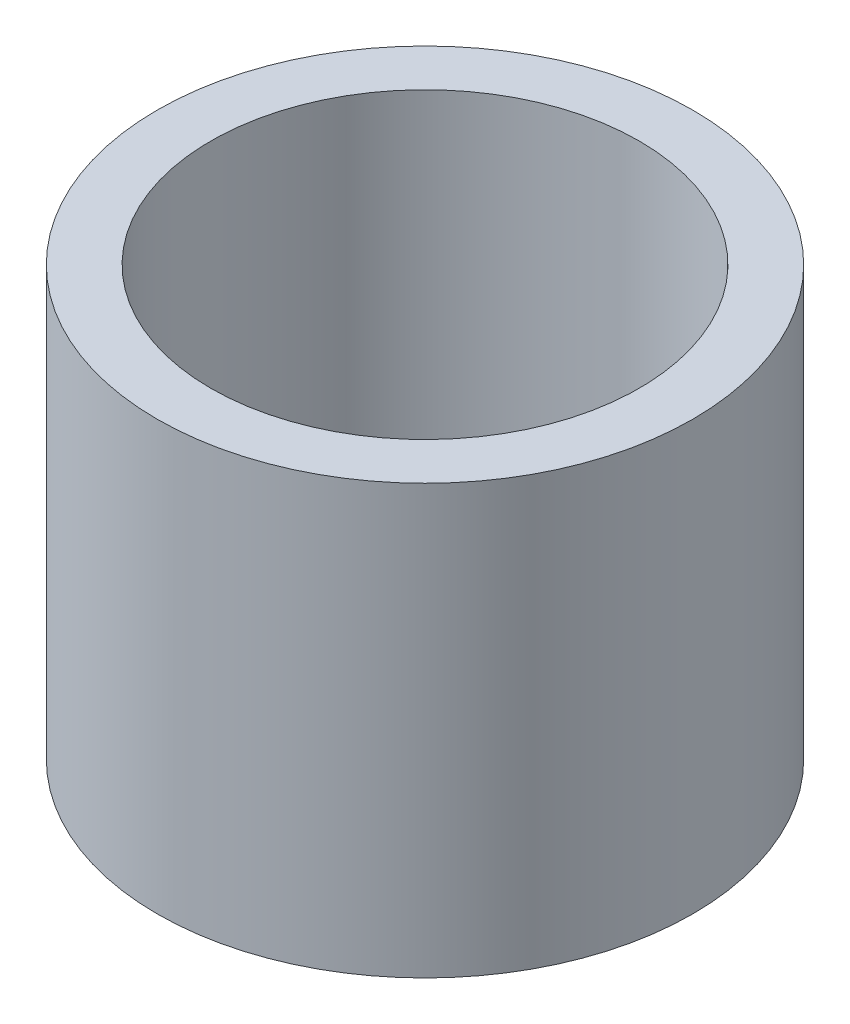
ISO-10303-21;
HEADER;
FILE_DESCRIPTION(('STEP AP214'),'2;1');
FILE_NAME('part.step','',(''),(''),'','','');
FILE_SCHEMA(('AUTOMOTIVE_DESIGN { 1 0 10303 214 1 1 1 1 }'));
ENDSEC;
DATA;
#1=APPLICATION_CONTEXT('core data for automotive mechanical design processes');
#2=APPLICATION_PROTOCOL_DEFINITION('international standard','automotive_design',2000,#1);
#3=PRODUCT_CONTEXT('',#1,'mechanical');
#4=PRODUCT('Part','Part','',(#3));
#5=PRODUCT_RELATED_PRODUCT_CATEGORY('part','',(#4));
#6=PRODUCT_DEFINITION_FORMATION('','',#4);
#7=PRODUCT_DEFINITION_CONTEXT('part definition',#1,'design');
#8=PRODUCT_DEFINITION('design','',#6,#7);
#9=PRODUCT_DEFINITION_SHAPE('','',#8);
#10=(LENGTH_UNIT() NAMED_UNIT(*) SI_UNIT(.MILLI.,.METRE.));
#11=(NAMED_UNIT(*) PLANE_ANGLE_UNIT() SI_UNIT($,.RADIAN.));
#12=(NAMED_UNIT(*) SI_UNIT($,.STERADIAN.) SOLID_ANGLE_UNIT());
#13=UNCERTAINTY_MEASURE_WITH_UNIT(LENGTH_MEASURE(1.E-05),#10,'distance_accuracy_value','');
#14=(GEOMETRIC_REPRESENTATION_CONTEXT(3) GLOBAL_UNCERTAINTY_ASSIGNED_CONTEXT((#13)) GLOBAL_UNIT_ASSIGNED_CONTEXT((#10,
#11,#12)) REPRESENTATION_CONTEXT('',''));
#15=CARTESIAN_POINT('',(0.,0.,0.));
#16=DIRECTION('',(0.,0.,1.));
#17=DIRECTION('',(1.,0.,0.));
#18=AXIS2_PLACEMENT_3D('',#15,#16,#17);
#19=CARTESIAN_POINT('',(0.,25.4,0.));
#20=DIRECTION('',(0.,1.,0.));
#21=DIRECTION('',(0.,0.,1.));
#22=AXIS2_PLACEMENT_3D('',#19,#20,#21);
#23=PLANE('',#22);
#24=CARTESIAN_POINT('',(0.,25.4,0.));
#25=DIRECTION('',(0.,1.,0.));
#26=DIRECTION('',(0.,0.,1.));
#27=AXIS2_PLACEMENT_3D('',#24,#25,#26);
#28=CIRCLE('',#27,15.875);
#29=CARTESIAN_POINT('',(0.,25.4,15.875));
#30=VERTEX_POINT('',#29);
#31=EDGE_CURVE('E10',#30,#30,#28,.T.);
#32=ORIENTED_EDGE('',*,*,#31,.T.);
#33=EDGE_LOOP('',(#32));
#34=FACE_BOUND('',#33,.T.);
#35=CARTESIAN_POINT('',(0.,25.4,0.));
#36=DIRECTION('',(0.,1.,0.));
#37=DIRECTION('',(0.,0.,1.));
#38=AXIS2_PLACEMENT_3D('',#35,#36,#37);
#39=CIRCLE('',#38,12.7);
#40=CARTESIAN_POINT('',(0.,25.4,12.7));
#41=VERTEX_POINT('',#40);
#42=EDGE_CURVE('E42',#41,#41,#39,.T.);
#43=ORIENTED_EDGE('',*,*,#42,.F.);
#44=EDGE_LOOP('',(#43));
#45=FACE_BOUND('',#44,.T.);
#46=ADVANCED_FACE('F31',(#34,#45),#23,.T.);
#47=CARTESIAN_POINT('',(0.,0.,0.));
#48=DIRECTION('',(0.,1.,0.));
#49=DIRECTION('',(0.,0.,1.));
#50=AXIS2_PLACEMENT_3D('',#47,#48,#49);
#51=PLANE('',#50);
#52=CARTESIAN_POINT('',(0.,0.,0.));
#53=DIRECTION('',(0.,1.,0.));
#54=DIRECTION('',(0.,0.,1.));
#55=AXIS2_PLACEMENT_3D('',#52,#53,#54);
#56=CIRCLE('',#55,15.875);
#57=CARTESIAN_POINT('',(0.,0.,15.875));
#58=VERTEX_POINT('',#57);
#59=EDGE_CURVE('E35',#58,#58,#56,.T.);
#60=ORIENTED_EDGE('',*,*,#59,.F.);
#61=EDGE_LOOP('',(#60));
#62=FACE_BOUND('',#61,.T.);
#63=CARTESIAN_POINT('',(0.,0.,0.));
#64=DIRECTION('',(0.,1.,0.));
#65=DIRECTION('',(0.,0.,1.));
#66=AXIS2_PLACEMENT_3D('',#63,#64,#65);
#67=CIRCLE('',#66,12.7);
#68=CARTESIAN_POINT('',(0.,0.,12.7));
#69=VERTEX_POINT('',#68);
#70=EDGE_CURVE('E44',#69,#69,#67,.T.);
#71=ORIENTED_EDGE('',*,*,#70,.T.);
#72=EDGE_LOOP('',(#71));
#73=FACE_BOUND('',#72,.T.);
#74=ADVANCED_FACE('F54',(#62,#73),#51,.F.);
#75=CARTESIAN_POINT('',(0.,25.4,0.));
#76=DIRECTION('',(0.,-1.,0.));
#77=DIRECTION('',(0.,0.,-1.));
#78=AXIS2_PLACEMENT_3D('',#75,#76,#77);
#79=CYLINDRICAL_SURFACE('',#78,15.875);
#80=ORIENTED_EDGE('',*,*,#31,.F.);
#81=EDGE_LOOP('',(#80));
#82=FACE_BOUND('',#81,.T.);
#83=ORIENTED_EDGE('',*,*,#59,.T.);
#84=EDGE_LOOP('',(#83));
#85=FACE_BOUND('',#84,.T.);
#86=ADVANCED_FACE('F33',(#82,#85),#79,.T.);
#87=CARTESIAN_POINT('',(0.,25.4,0.));
#88=DIRECTION('',(0.,-1.,0.));
#89=DIRECTION('',(0.,0.,-1.));
#90=AXIS2_PLACEMENT_3D('',#87,#88,#89);
#91=CYLINDRICAL_SURFACE('',#90,12.7);
#92=ORIENTED_EDGE('',*,*,#42,.T.);
#93=EDGE_LOOP('',(#92));
#94=FACE_BOUND('',#93,.T.);
#95=ORIENTED_EDGE('',*,*,#70,.F.);
#96=EDGE_LOOP('',(#95));
#97=FACE_BOUND('',#96,.T.);
#98=ADVANCED_FACE('F50',(#94,#97),#91,.F.);
#99=CLOSED_SHELL('',(#46,#74,#86,#98));
#100=MANIFOLD_SOLID_BREP('B2',#99);
#101=ADVANCED_BREP_SHAPE_REPRESENTATION('',(#18,#100),#14);
#102=SHAPE_DEFINITION_REPRESENTATION(#9,#101);
ENDSEC;
END-ISO-10303-21;
